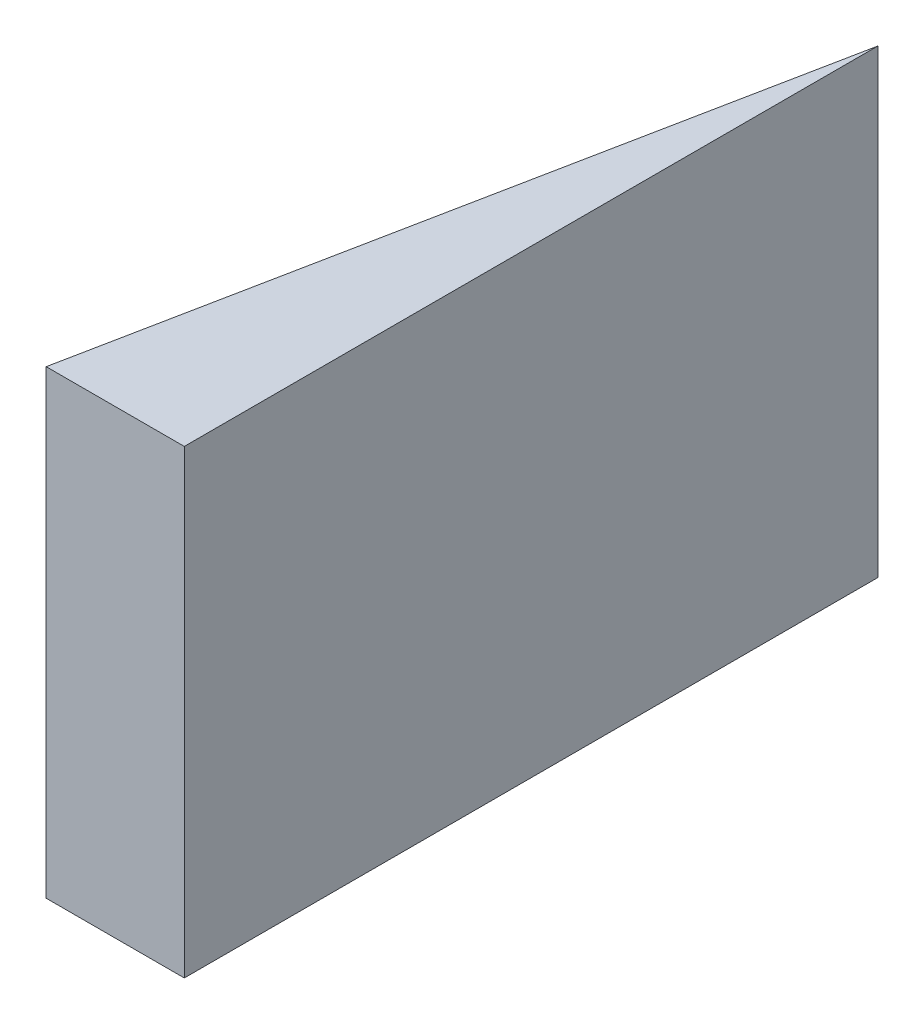
ISO-10303-21;
HEADER;
FILE_DESCRIPTION(('STEP AP214'),'2;1');
FILE_NAME('part.step','',(''),(''),'','','');
FILE_SCHEMA(('AUTOMOTIVE_DESIGN { 1 0 10303 214 1 1 1 1 }'));
ENDSEC;
DATA;
#1=APPLICATION_CONTEXT('core data for automotive mechanical design processes');
#2=APPLICATION_PROTOCOL_DEFINITION('international standard','automotive_design',2000,#1);
#3=PRODUCT_CONTEXT('',#1,'mechanical');
#4=PRODUCT('Part','Part','',(#3));
#5=PRODUCT_RELATED_PRODUCT_CATEGORY('part','',(#4));
#6=PRODUCT_DEFINITION_FORMATION('','',#4);
#7=PRODUCT_DEFINITION_CONTEXT('part definition',#1,'design');
#8=PRODUCT_DEFINITION('design','',#6,#7);
#9=PRODUCT_DEFINITION_SHAPE('','',#8);
#10=(LENGTH_UNIT() NAMED_UNIT(*) SI_UNIT(.MILLI.,.METRE.));
#11=(NAMED_UNIT(*) PLANE_ANGLE_UNIT() SI_UNIT($,.RADIAN.));
#12=(NAMED_UNIT(*) SI_UNIT($,.STERADIAN.) SOLID_ANGLE_UNIT());
#13=UNCERTAINTY_MEASURE_WITH_UNIT(LENGTH_MEASURE(1.E-05),#10,'distance_accuracy_value','');
#14=(GEOMETRIC_REPRESENTATION_CONTEXT(3) GLOBAL_UNCERTAINTY_ASSIGNED_CONTEXT((#13)) GLOBAL_UNIT_ASSIGNED_CONTEXT((#10,
#11,#12)) REPRESENTATION_CONTEXT('',''));
#15=CARTESIAN_POINT('',(0.,0.,0.));
#16=DIRECTION('',(0.,0.,1.));
#17=DIRECTION('',(1.,0.,0.));
#18=AXIS2_PLACEMENT_3D('',#15,#16,#17);
#19=CARTESIAN_POINT('',(-3.37532170631,-0.750000045305344,-5.23287741907118));
#20=DIRECTION('',(0.,-1.,-8.74227765734759E-08));
#21=DIRECTION('',(1.,0.,0.));
#22=AXIS2_PLACEMENT_3D('',#19,#20,#21);
#23=PLANE('',#22);
#24=DIRECTION('',(-1.,0.,0.));
#25=VECTOR('',#24,1.);
#26=CARTESIAN_POINT('',(-3.,-0.750000183586831,-3.65112158656318));
#27=LINE('',#26,#25);
#28=CARTESIAN_POINT('',(-3.,-0.750000183588831,-3.65112158656318));
#29=VERTEX_POINT('',#28);
#30=CARTESIAN_POINT('',(-3.3,-0.750000183588831,-3.65112158656418));
#31=VERTEX_POINT('',#30);
#32=EDGE_CURVE('E11',#29,#31,#27,.T.);
#33=ORIENTED_EDGE('',*,*,#32,.F.);
#34=DIRECTION('',(0.,-8.74227765663743E-08,0.999999999999996));
#35=VECTOR('',#34,1.);
#36=CARTESIAN_POINT('',(-3.,-0.750000051890177,-5.15755571276118));
#37=LINE('',#36,#35);
#38=CARTESIAN_POINT('',(-3.,-0.750000051892177,-5.15755571276018));
#39=VERTEX_POINT('',#38);
#40=EDGE_CURVE('E63',#39,#29,#37,.T.);
#41=ORIENTED_EDGE('',*,*,#40,.F.);
#42=DIRECTION('',(0.195310522456618,8.57391410123929E-08,-0.980741454114037));
#43=VECTOR('',#42,1.);
#44=CARTESIAN_POINT('',(-3.3,-0.75000018358683,-3.65112158656318));
#45=LINE('',#44,#43);
#46=EDGE_CURVE('E70',#31,#39,#45,.T.);
#47=ORIENTED_EDGE('',*,*,#46,.F.);
#48=EDGE_LOOP('',(#33,#41,#47));
#49=FACE_BOUND('',#48,.T.);
#50=ADVANCED_FACE('F17',(#49),#23,.F.);
#51=CARTESIAN_POINT('',(-3.37532170631,-1.75000004530634,-5.23287750649395));
#52=DIRECTION('',(0.,-1.,-8.74227765734759E-08));
#53=DIRECTION('',(1.,0.,0.));
#54=AXIS2_PLACEMENT_3D('',#51,#52,#53);
#55=PLANE('',#54);
#56=DIRECTION('',(0.195310522456618,8.57391410123928E-08,-0.980741454114037));
#57=VECTOR('',#56,1.);
#58=CARTESIAN_POINT('',(-3.3,-1.75000018358783,-3.65112167398595));
#59=LINE('',#58,#57);
#60=CARTESIAN_POINT('',(-3.3,-1.75000018358683,-3.65112167398695));
#61=VERTEX_POINT('',#60);
#62=CARTESIAN_POINT('',(-3.,-1.75000005189018,-5.15755580018295));
#63=VERTEX_POINT('',#62);
#64=EDGE_CURVE('E24',#61,#63,#59,.T.);
#65=ORIENTED_EDGE('',*,*,#64,.T.);
#66=DIRECTION('',(0.,-8.74227765663743E-08,0.999999999999996));
#67=VECTOR('',#66,1.);
#68=CARTESIAN_POINT('',(-3.,-1.75000005189118,-5.15755580018395));
#69=LINE('',#68,#67);
#70=CARTESIAN_POINT('',(-3.,-1.75000018358683,-3.65112167398595));
#71=VERTEX_POINT('',#70);
#72=EDGE_CURVE('E49',#63,#71,#69,.T.);
#73=ORIENTED_EDGE('',*,*,#72,.T.);
#74=DIRECTION('',(-1.,0.,0.));
#75=VECTOR('',#74,1.);
#76=CARTESIAN_POINT('',(-3.,-1.75000018358783,-3.65112167398595));
#77=LINE('',#76,#75);
#78=EDGE_CURVE('E46',#71,#61,#77,.T.);
#79=ORIENTED_EDGE('',*,*,#78,.T.);
#80=EDGE_LOOP('',(#65,#73,#79));
#81=FACE_BOUND('',#80,.T.);
#82=ADVANCED_FACE('F47',(#81),#55,.T.);
#83=CARTESIAN_POINT('',(-3.3,-0.750000183586831,-3.65112158656318));
#84=DIRECTION('',(-0.980741454114041,1.70745881893227E-08,-0.195310522456619));
#85=DIRECTION('',(0.195310522456619,8.57391410193576E-08,-0.980741454114041));
#86=AXIS2_PLACEMENT_3D('',#83,#84,#85);
#87=PLANE('',#86);
#88=ORIENTED_EDGE('',*,*,#46,.T.);
#89=DIRECTION('',(0.,-0.999999999999996,-8.74227774615665E-08));
#90=VECTOR('',#89,1.);
#91=CARTESIAN_POINT('',(-3.,-0.750000051890176,-5.15755571276118));
#92=LINE('',#91,#90);
#93=EDGE_CURVE('E54',#39,#63,#92,.T.);
#94=ORIENTED_EDGE('',*,*,#93,.T.);
#95=ORIENTED_EDGE('',*,*,#64,.F.);
#96=DIRECTION('',(0.,-0.999999999999996,-8.74227765733881E-08));
#97=VECTOR('',#96,1.);
#98=CARTESIAN_POINT('',(-3.3,-0.750000183586831,-3.65112158656318));
#99=LINE('',#98,#97);
#100=EDGE_CURVE('E61',#31,#61,#99,.T.);
#101=ORIENTED_EDGE('',*,*,#100,.F.);
#102=EDGE_LOOP('',(#88,#94,#95,#101));
#103=FACE_BOUND('',#102,.T.);
#104=ADVANCED_FACE('F60',(#103),#87,.T.);
#105=CARTESIAN_POINT('',(-3.,-0.750000051890177,-5.15755571276118));
#106=DIRECTION('',(1.,0.,0.));
#107=DIRECTION('',(0.,-8.74227765734759E-08,1.));
#108=AXIS2_PLACEMENT_3D('',#105,#106,#107);
#109=PLANE('',#108);
#110=ORIENTED_EDGE('',*,*,#40,.T.);
#111=DIRECTION('',(0.,-0.999999999999996,-8.74227765733881E-08));
#112=VECTOR('',#111,1.);
#113=CARTESIAN_POINT('',(-3.,-0.750000183586831,-3.65112158656318));
#114=LINE('',#113,#112);
#115=EDGE_CURVE('E55',#29,#71,#114,.T.);
#116=ORIENTED_EDGE('',*,*,#115,.T.);
#117=ORIENTED_EDGE('',*,*,#72,.F.);
#118=ORIENTED_EDGE('',*,*,#93,.F.);
#119=EDGE_LOOP('',(#110,#116,#117,#118));
#120=FACE_BOUND('',#119,.T.);
#121=ADVANCED_FACE('F73',(#120),#109,.T.);
#122=CARTESIAN_POINT('',(-3.,-0.750000183586831,-3.65112158656318));
#123=DIRECTION('',(0.,-8.74227765734759E-08,1.));
#124=DIRECTION('',(-1.,0.,0.));
#125=AXIS2_PLACEMENT_3D('',#122,#123,#124);
#126=PLANE('',#125);
#127=ORIENTED_EDGE('',*,*,#32,.T.);
#128=ORIENTED_EDGE('',*,*,#100,.T.);
#129=ORIENTED_EDGE('',*,*,#78,.F.);
#130=ORIENTED_EDGE('',*,*,#115,.F.);
#131=EDGE_LOOP('',(#127,#128,#129,#130));
#132=FACE_BOUND('',#131,.T.);
#133=ADVANCED_FACE('F64',(#132),#126,.T.);
#134=CLOSED_SHELL('',(#50,#82,#104,#121,#133));
#135=MANIFOLD_SOLID_BREP('B1',#134);
#136=ADVANCED_BREP_SHAPE_REPRESENTATION('',(#18,#135),#14);
#137=SHAPE_DEFINITION_REPRESENTATION(#9,#136);
ENDSEC;
END-ISO-10303-21;
